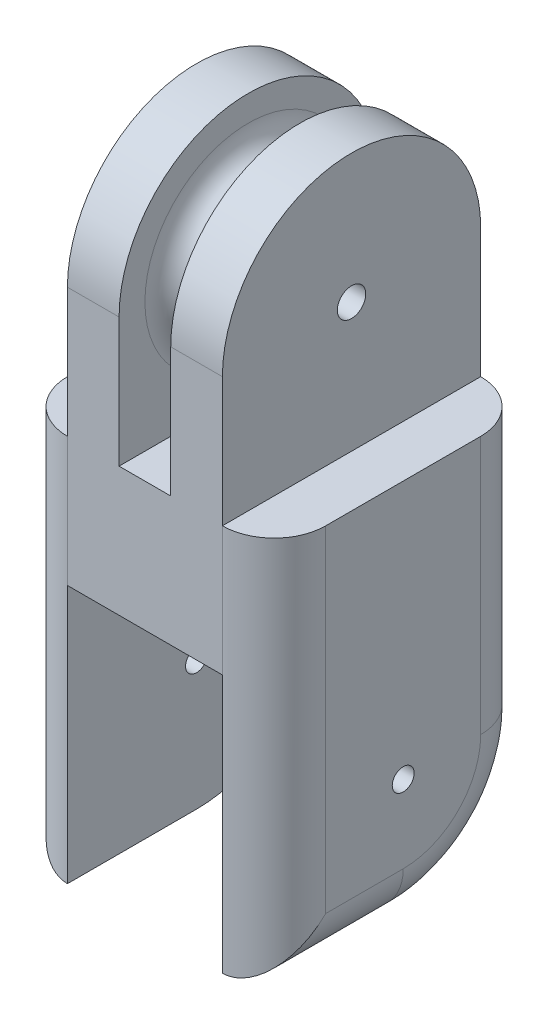
ISO-10303-21;
HEADER;
FILE_DESCRIPTION(('STEP AP214'),'2;1');
FILE_NAME('part.step','',(''),(''),'','','');
FILE_SCHEMA(('AUTOMOTIVE_DESIGN { 1 0 10303 214 1 1 1 1 }'));
ENDSEC;
DATA;
#1=APPLICATION_CONTEXT('core data for automotive mechanical design processes');
#2=APPLICATION_PROTOCOL_DEFINITION('international standard','automotive_design',2000,#1);
#3=PRODUCT_CONTEXT('',#1,'mechanical');
#4=PRODUCT('Part','Part','',(#3));
#5=PRODUCT_RELATED_PRODUCT_CATEGORY('part','',(#4));
#6=PRODUCT_DEFINITION_FORMATION('','',#4);
#7=PRODUCT_DEFINITION_CONTEXT('part definition',#1,'design');
#8=PRODUCT_DEFINITION('design','',#6,#7);
#9=PRODUCT_DEFINITION_SHAPE('','',#8);
#10=(LENGTH_UNIT() NAMED_UNIT(*) SI_UNIT(.MILLI.,.METRE.));
#11=(NAMED_UNIT(*) PLANE_ANGLE_UNIT() SI_UNIT($,.RADIAN.));
#12=(NAMED_UNIT(*) SI_UNIT($,.STERADIAN.) SOLID_ANGLE_UNIT());
#13=UNCERTAINTY_MEASURE_WITH_UNIT(LENGTH_MEASURE(1.E-05),#10,'distance_accuracy_value','');
#14=(GEOMETRIC_REPRESENTATION_CONTEXT(3) GLOBAL_UNCERTAINTY_ASSIGNED_CONTEXT((#13)) GLOBAL_UNIT_ASSIGNED_CONTEXT((#10,
#11,#12)) REPRESENTATION_CONTEXT('',''));
#15=CARTESIAN_POINT('',(0.,0.,0.));
#16=DIRECTION('',(0.,0.,1.));
#17=DIRECTION('',(1.,0.,0.));
#18=AXIS2_PLACEMENT_3D('',#15,#16,#17);
#19=CARTESIAN_POINT('',(0.,10.,0.));
#20=DIRECTION('',(0.,1.,0.));
#21=DIRECTION('',(0.,0.,1.));
#22=AXIS2_PLACEMENT_3D('',#19,#20,#21);
#23=PLANE('',#22);
#24=CARTESIAN_POINT('',(-6.,10.,6.));
#25=DIRECTION('',(0.,1.,0.));
#26=DIRECTION('',(0.,0.,1.));
#27=AXIS2_PLACEMENT_3D('',#24,#25,#26);
#28=CIRCLE('',#27,4.);
#29=CARTESIAN_POINT('',(-10.,10.,6.));
#30=VERTEX_POINT('',#29);
#31=CARTESIAN_POINT('',(-6.,10.,10.));
#32=VERTEX_POINT('',#31);
#33=EDGE_CURVE('E372',#30,#32,#28,.T.);
#34=ORIENTED_EDGE('',*,*,#33,.T.);
#35=DIRECTION('',(0.,0.,1.));
#36=VECTOR('',#35,1.);
#37=CARTESIAN_POINT('',(-6.,10.,10.));
#38=LINE('',#37,#36);
#39=CARTESIAN_POINT('',(-6.,10.,-10.));
#40=VERTEX_POINT('',#39);
#41=EDGE_CURVE('E172',#40,#32,#38,.T.);
#42=ORIENTED_EDGE('',*,*,#41,.F.);
#43=CARTESIAN_POINT('',(-6.,10.,-6.));
#44=DIRECTION('',(0.,1.,0.));
#45=DIRECTION('',(0.,0.,1.));
#46=AXIS2_PLACEMENT_3D('',#43,#44,#45);
#47=CIRCLE('',#46,4.);
#48=CARTESIAN_POINT('',(-10.,10.,-6.));
#49=VERTEX_POINT('',#48);
#50=EDGE_CURVE('E369',#40,#49,#47,.T.);
#51=ORIENTED_EDGE('',*,*,#50,.T.);
#52=DIRECTION('',(0.,0.,1.));
#53=VECTOR('',#52,1.);
#54=CARTESIAN_POINT('',(-10.,10.,-10.));
#55=LINE('',#54,#53);
#56=EDGE_CURVE('E310',#49,#30,#55,.T.);
#57=ORIENTED_EDGE('',*,*,#56,.T.);
#58=EDGE_LOOP('',(#34,#42,#51,#57));
#59=FACE_BOUND('',#58,.T.);
#60=ADVANCED_FACE('F39',(#59),#23,.T.);
#61=CARTESIAN_POINT('',(0.,10.,-6.));
#62=DIRECTION('',(0.,1.,0.));
#63=DIRECTION('',(0.,0.,1.));
#64=AXIS2_PLACEMENT_3D('',#61,#62,#63);
#65=CIRCLE('',#64,0.5);
#66=CARTESIAN_POINT('',(0.,10.,-5.5));
#67=VERTEX_POINT('',#66);
#68=EDGE_CURVE('E426',#67,#67,#65,.F.);
#69=ORIENTED_EDGE('',*,*,#68,.T.);
#70=EDGE_LOOP('',(#69));
#71=FACE_BOUND('',#70,.T.);
#72=CARTESIAN_POINT('',(0.,10.,6.));
#73=DIRECTION('',(0.,1.,0.));
#74=DIRECTION('',(0.,0.,1.));
#75=AXIS2_PLACEMENT_3D('',#72,#73,#74);
#76=CIRCLE('',#75,0.5);
#77=CARTESIAN_POINT('',(0.,10.,6.5));
#78=VERTEX_POINT('',#77);
#79=EDGE_CURVE('E435',#78,#78,#76,.F.);
#80=ORIENTED_EDGE('',*,*,#79,.T.);
#81=EDGE_LOOP('',(#80));
#82=FACE_BOUND('',#81,.T.);
#83=DIRECTION('',(-1.,0.,0.));
#84=VECTOR('',#83,1.);
#85=CARTESIAN_POINT('',(-10.,10.,-10.));
#86=LINE('',#85,#84);
#87=CARTESIAN_POINT('',(2.,10.,-10.));
#88=VERTEX_POINT('',#87);
#89=CARTESIAN_POINT('',(-2.,10.,-10.));
#90=VERTEX_POINT('',#89);
#91=EDGE_CURVE('E322',#88,#90,#86,.T.);
#92=ORIENTED_EDGE('',*,*,#91,.T.);
#93=DIRECTION('',(0.,0.,-1.));
#94=VECTOR('',#93,1.);
#95=CARTESIAN_POINT('',(-2.,10.,10.));
#96=LINE('',#95,#94);
#97=CARTESIAN_POINT('',(-2.,10.,10.));
#98=VERTEX_POINT('',#97);
#99=EDGE_CURVE('E56',#98,#90,#96,.T.);
#100=ORIENTED_EDGE('',*,*,#99,.F.);
#101=DIRECTION('',(1.,0.,0.));
#102=VECTOR('',#101,1.);
#103=CARTESIAN_POINT('',(-10.,10.,10.));
#104=LINE('',#103,#102);
#105=CARTESIAN_POINT('',(2.,10.,10.));
#106=VERTEX_POINT('',#105);
#107=EDGE_CURVE('E314',#98,#106,#104,.T.);
#108=ORIENTED_EDGE('',*,*,#107,.T.);
#109=DIRECTION('',(0.,0.,1.));
#110=VECTOR('',#109,1.);
#111=CARTESIAN_POINT('',(2.,10.,10.));
#112=LINE('',#111,#110);
#113=EDGE_CURVE('E231',#88,#106,#112,.T.);
#114=ORIENTED_EDGE('',*,*,#113,.F.);
#115=EDGE_LOOP('',(#92,#100,#108,#114));
#116=FACE_BOUND('',#115,.T.);
#117=ADVANCED_FACE('F512',(#71,#82,#116),#23,.T.);
#118=DIRECTION('',(0.,0.,-1.));
#119=VECTOR('',#118,1.);
#120=CARTESIAN_POINT('',(6.,10.,10.));
#121=LINE('',#120,#119);
#122=CARTESIAN_POINT('',(6.,10.,10.));
#123=VERTEX_POINT('',#122);
#124=CARTESIAN_POINT('',(6.,10.,-10.));
#125=VERTEX_POINT('',#124);
#126=EDGE_CURVE('E176',#123,#125,#121,.T.);
#127=ORIENTED_EDGE('',*,*,#126,.F.);
#128=CARTESIAN_POINT('',(6.,10.,6.));
#129=DIRECTION('',(0.,1.,0.));
#130=DIRECTION('',(0.,0.,1.));
#131=AXIS2_PLACEMENT_3D('',#128,#129,#130);
#132=CIRCLE('',#131,4.);
#133=CARTESIAN_POINT('',(10.,10.,6.));
#134=VERTEX_POINT('',#133);
#135=EDGE_CURVE('E375',#123,#134,#132,.T.);
#136=ORIENTED_EDGE('',*,*,#135,.T.);
#137=DIRECTION('',(0.,0.,-1.));
#138=VECTOR('',#137,1.);
#139=CARTESIAN_POINT('',(10.,10.,-10.));
#140=LINE('',#139,#138);
#141=CARTESIAN_POINT('',(10.,10.,-6.));
#142=VERTEX_POINT('',#141);
#143=EDGE_CURVE('E318',#134,#142,#140,.T.);
#144=ORIENTED_EDGE('',*,*,#143,.T.);
#145=CARTESIAN_POINT('',(6.,10.,-6.));
#146=DIRECTION('',(0.,1.,0.));
#147=DIRECTION('',(0.,0.,1.));
#148=AXIS2_PLACEMENT_3D('',#145,#146,#147);
#149=CIRCLE('',#148,4.);
#150=EDGE_CURVE('E365',#142,#125,#149,.T.);
#151=ORIENTED_EDGE('',*,*,#150,.T.);
#152=EDGE_LOOP('',(#127,#136,#144,#151));
#153=FACE_BOUND('',#152,.T.);
#154=ADVANCED_FACE('F448',(#153),#23,.T.);
#155=CARTESIAN_POINT('',(0.,0.,0.));
#156=DIRECTION('',(0.,1.,0.));
#157=DIRECTION('',(0.,0.,1.));
#158=AXIS2_PLACEMENT_3D('',#155,#156,#157);
#159=PLANE('',#158);
#160=CARTESIAN_POINT('',(0.,0.,-6.));
#161=DIRECTION('',(0.,-1.,0.));
#162=DIRECTION('',(0.,0.,-1.));
#163=AXIS2_PLACEMENT_3D('',#160,#161,#162);
#164=CIRCLE('',#163,0.5);
#165=CARTESIAN_POINT('',(0.,0.,-6.5));
#166=VERTEX_POINT('',#165);
#167=EDGE_CURVE('E420',#166,#166,#164,.T.);
#168=ORIENTED_EDGE('',*,*,#167,.F.);
#169=EDGE_LOOP('',(#168));
#170=FACE_BOUND('',#169,.T.);
#171=CARTESIAN_POINT('',(0.,0.,6.));
#172=DIRECTION('',(0.,-1.,0.));
#173=DIRECTION('',(0.,0.,1.));
#174=AXIS2_PLACEMENT_3D('',#171,#172,#173);
#175=CIRCLE('',#174,0.5);
#176=CARTESIAN_POINT('',(0.,0.,6.5));
#177=VERTEX_POINT('',#176);
#178=EDGE_CURVE('E432',#177,#177,#175,.T.);
#179=ORIENTED_EDGE('',*,*,#178,.F.);
#180=EDGE_LOOP('',(#179));
#181=FACE_BOUND('',#180,.T.);
#182=DIRECTION('',(0.,0.,-1.));
#183=VECTOR('',#182,1.);
#184=CARTESIAN_POINT('',(6.,0.,-10.));
#185=LINE('',#184,#183);
#186=CARTESIAN_POINT('',(6.,0.,10.));
#187=VERTEX_POINT('',#186);
#188=CARTESIAN_POINT('',(6.,0.,-10.));
#189=VERTEX_POINT('',#188);
#190=EDGE_CURVE('E286',#187,#189,#185,.T.);
#191=ORIENTED_EDGE('',*,*,#190,.F.);
#192=DIRECTION('',(1.,0.,0.));
#193=VECTOR('',#192,1.);
#194=CARTESIAN_POINT('',(-10.,0.,10.));
#195=LINE('',#194,#193);
#196=CARTESIAN_POINT('',(-6.,0.,10.));
#197=VERTEX_POINT('',#196);
#198=EDGE_CURVE('E309',#197,#187,#195,.T.);
#199=ORIENTED_EDGE('',*,*,#198,.F.);
#200=DIRECTION('',(0.,0.,1.));
#201=VECTOR('',#200,1.);
#202=CARTESIAN_POINT('',(-6.,0.,10.));
#203=LINE('',#202,#201);
#204=CARTESIAN_POINT('',(-6.,0.,-10.));
#205=VERTEX_POINT('',#204);
#206=EDGE_CURVE('E297',#205,#197,#203,.T.);
#207=ORIENTED_EDGE('',*,*,#206,.F.);
#208=DIRECTION('',(-1.,0.,0.));
#209=VECTOR('',#208,1.);
#210=CARTESIAN_POINT('',(-10.,0.,-10.));
#211=LINE('',#210,#209);
#212=EDGE_CURVE('E315',#189,#205,#211,.T.);
#213=ORIENTED_EDGE('',*,*,#212,.F.);
#214=EDGE_LOOP('',(#191,#199,#207,#213));
#215=FACE_BOUND('',#214,.T.);
#216=ADVANCED_FACE('F444',(#170,#181,#215),#159,.F.);
#217=CARTESIAN_POINT('',(-10.,10.,-10.));
#218=DIRECTION('',(1.,0.,0.));
#219=DIRECTION('',(0.,0.,-1.));
#220=AXIS2_PLACEMENT_3D('',#217,#218,#219);
#221=PLANE('',#220);
#222=CARTESIAN_POINT('',(-10.,-10.,0.));
#223=DIRECTION('',(-1.,0.,0.));
#224=DIRECTION('',(0.,0.,1.));
#225=AXIS2_PLACEMENT_3D('',#222,#223,#224);
#226=CIRCLE('',#225,0.85);
#227=CARTESIAN_POINT('',(-10.,-10.,0.850000000000001));
#228=VERTEX_POINT('',#227);
#229=EDGE_CURVE('E261',#228,#228,#226,.T.);
#230=ORIENTED_EDGE('',*,*,#229,.F.);
#231=EDGE_LOOP('',(#230));
#232=FACE_BOUND('',#231,.T.);
#233=DIRECTION('',(0.,0.,1.));
#234=VECTOR('',#233,1.);
#235=CARTESIAN_POINT('',(-10.,-16.,10.));
#236=LINE('',#235,#234);
#237=CARTESIAN_POINT('',(-10.,-16.,0.));
#238=VERTEX_POINT('',#237);
#239=CARTESIAN_POINT('',(-10.,-16.,6.));
#240=VERTEX_POINT('',#239);
#241=EDGE_CURVE('E338',#238,#240,#236,.T.);
#242=ORIENTED_EDGE('',*,*,#241,.T.);
#243=DIRECTION('',(0.,-1.,0.));
#244=VECTOR('',#243,1.);
#245=CARTESIAN_POINT('',(-10.,10.,6.));
#246=LINE('',#245,#244);
#247=EDGE_CURVE('E342',#240,#30,#246,.F.);
#248=ORIENTED_EDGE('',*,*,#247,.T.);
#249=ORIENTED_EDGE('',*,*,#56,.F.);
#250=DIRECTION('',(0.,-1.,0.));
#251=VECTOR('',#250,1.);
#252=CARTESIAN_POINT('',(-10.,10.,-6.));
#253=LINE('',#252,#251);
#254=CARTESIAN_POINT('',(-10.,-10.,-6.));
#255=VERTEX_POINT('',#254);
#256=EDGE_CURVE('E325',#49,#255,#253,.T.);
#257=ORIENTED_EDGE('',*,*,#256,.T.);
#258=CARTESIAN_POINT('',(-10.,-10.,0.));
#259=DIRECTION('',(1.,0.,0.));
#260=DIRECTION('',(0.,0.,-1.));
#261=AXIS2_PLACEMENT_3D('',#258,#259,#260);
#262=CIRCLE('',#261,6.);
#263=EDGE_CURVE('E335',#255,#238,#262,.F.);
#264=ORIENTED_EDGE('',*,*,#263,.T.);
#265=EDGE_LOOP('',(#242,#248,#249,#257,#264));
#266=FACE_BOUND('',#265,.T.);
#267=ADVANCED_FACE('F447',(#232,#266),#221,.F.);
#268=CARTESIAN_POINT('',(-10.,10.,10.));
#269=DIRECTION('',(0.,0.,-1.));
#270=DIRECTION('',(-1.,0.,0.));
#271=AXIS2_PLACEMENT_3D('',#268,#269,#270);
#272=PLANE('',#271);
#273=ORIENTED_EDGE('',*,*,#198,.T.);
#274=DIRECTION('',(0.,-1.,0.));
#275=VECTOR('',#274,1.);
#276=CARTESIAN_POINT('',(6.,10.,10.));
#277=LINE('',#276,#275);
#278=EDGE_CURVE('E361',#187,#123,#277,.F.);
#279=ORIENTED_EDGE('',*,*,#278,.T.);
#280=DIRECTION('',(0.,-1.,0.));
#281=VECTOR('',#280,1.);
#282=CARTESIAN_POINT('',(6.,20.,10.));
#283=LINE('',#282,#281);
#284=CARTESIAN_POINT('',(6.,20.,10.));
#285=VERTEX_POINT('',#284);
#286=EDGE_CURVE('E235',#285,#123,#283,.T.);
#287=ORIENTED_EDGE('',*,*,#286,.F.);
#288=DIRECTION('',(1.,0.,0.));
#289=VECTOR('',#288,1.);
#290=CARTESIAN_POINT('',(6.,20.,10.));
#291=LINE('',#290,#289);
#292=CARTESIAN_POINT('',(2.,20.,10.));
#293=VERTEX_POINT('',#292);
#294=EDGE_CURVE('E230',#293,#285,#291,.T.);
#295=ORIENTED_EDGE('',*,*,#294,.F.);
#296=DIRECTION('',(0.,-1.,0.));
#297=VECTOR('',#296,1.);
#298=CARTESIAN_POINT('',(2.,20.,10.));
#299=LINE('',#298,#297);
#300=EDGE_CURVE('E243',#293,#106,#299,.T.);
#301=ORIENTED_EDGE('',*,*,#300,.T.);
#302=ORIENTED_EDGE('',*,*,#107,.F.);
#303=DIRECTION('',(0.,-1.,0.));
#304=VECTOR('',#303,1.);
#305=CARTESIAN_POINT('',(-2.,20.,10.));
#306=LINE('',#305,#304);
#307=CARTESIAN_POINT('',(-2.,20.,10.));
#308=VERTEX_POINT('',#307);
#309=EDGE_CURVE('E177',#308,#98,#306,.T.);
#310=ORIENTED_EDGE('',*,*,#309,.F.);
#311=DIRECTION('',(1.,0.,0.));
#312=VECTOR('',#311,1.);
#313=CARTESIAN_POINT('',(-6.,20.,10.));
#314=LINE('',#313,#312);
#315=CARTESIAN_POINT('',(-6.,20.,10.));
#316=VERTEX_POINT('',#315);
#317=EDGE_CURVE('E180',#316,#308,#314,.T.);
#318=ORIENTED_EDGE('',*,*,#317,.F.);
#319=DIRECTION('',(0.,-1.,0.));
#320=VECTOR('',#319,1.);
#321=CARTESIAN_POINT('',(-6.,20.,10.));
#322=LINE('',#321,#320);
#323=EDGE_CURVE('E165',#316,#32,#322,.T.);
#324=ORIENTED_EDGE('',*,*,#323,.T.);
#325=DIRECTION('',(0.,-1.,0.));
#326=VECTOR('',#325,1.);
#327=CARTESIAN_POINT('',(-6.,10.,10.));
#328=LINE('',#327,#326);
#329=EDGE_CURVE('E358',#32,#197,#328,.T.);
#330=ORIENTED_EDGE('',*,*,#329,.T.);
#331=EDGE_LOOP('',(#273,#279,#287,#295,#301,#302,#310,#318,#324,#330));
#332=FACE_BOUND('',#331,.T.);
#333=ADVANCED_FACE('F182',(#332),#272,.F.);
#334=CARTESIAN_POINT('',(10.,10.,-10.));
#335=DIRECTION('',(-1.,0.,0.));
#336=DIRECTION('',(0.,0.,1.));
#337=AXIS2_PLACEMENT_3D('',#334,#335,#336);
#338=PLANE('',#337);
#339=CARTESIAN_POINT('',(10.,-10.,0.));
#340=DIRECTION('',(-1.,0.,0.));
#341=DIRECTION('',(0.,0.,1.));
#342=AXIS2_PLACEMENT_3D('',#339,#340,#341);
#343=CIRCLE('',#342,0.85);
#344=CARTESIAN_POINT('',(10.,-10.,0.849999999999999));
#345=VERTEX_POINT('',#344);
#346=EDGE_CURVE('E256',#345,#345,#343,.T.);
#347=ORIENTED_EDGE('',*,*,#346,.T.);
#348=EDGE_LOOP('',(#347));
#349=FACE_BOUND('',#348,.T.);
#350=ORIENTED_EDGE('',*,*,#143,.F.);
#351=DIRECTION('',(0.,-1.,0.));
#352=VECTOR('',#351,1.);
#353=CARTESIAN_POINT('',(10.,10.,6.));
#354=LINE('',#353,#352);
#355=CARTESIAN_POINT('',(10.,-16.,6.));
#356=VERTEX_POINT('',#355);
#357=EDGE_CURVE('E355',#134,#356,#354,.T.);
#358=ORIENTED_EDGE('',*,*,#357,.T.);
#359=DIRECTION('',(0.,0.,-1.));
#360=VECTOR('',#359,1.);
#361=CARTESIAN_POINT('',(10.,-16.,0.));
#362=LINE('',#361,#360);
#363=CARTESIAN_POINT('',(10.,-16.,0.));
#364=VERTEX_POINT('',#363);
#365=EDGE_CURVE('E351',#356,#364,#362,.T.);
#366=ORIENTED_EDGE('',*,*,#365,.T.);
#367=CARTESIAN_POINT('',(10.,-10.,0.));
#368=DIRECTION('',(-1.,0.,0.));
#369=DIRECTION('',(0.,0.,1.));
#370=AXIS2_PLACEMENT_3D('',#367,#368,#369);
#371=CIRCLE('',#370,6.);
#372=CARTESIAN_POINT('',(10.,-10.,-6.));
#373=VERTEX_POINT('',#372);
#374=EDGE_CURVE('E348',#364,#373,#371,.F.);
#375=ORIENTED_EDGE('',*,*,#374,.T.);
#376=DIRECTION('',(0.,-1.,0.));
#377=VECTOR('',#376,1.);
#378=CARTESIAN_POINT('',(10.,10.,-6.));
#379=LINE('',#378,#377);
#380=EDGE_CURVE('E345',#373,#142,#379,.F.);
#381=ORIENTED_EDGE('',*,*,#380,.T.);
#382=EDGE_LOOP('',(#350,#358,#366,#375,#381));
#383=FACE_BOUND('',#382,.T.);
#384=ADVANCED_FACE('F507',(#349,#383),#338,.F.);
#385=CARTESIAN_POINT('',(-10.,10.,-10.));
#386=DIRECTION('',(0.,0.,1.));
#387=DIRECTION('',(1.,0.,0.));
#388=AXIS2_PLACEMENT_3D('',#385,#386,#387);
#389=PLANE('',#388);
#390=ORIENTED_EDGE('',*,*,#212,.T.);
#391=DIRECTION('',(0.,-1.,0.));
#392=VECTOR('',#391,1.);
#393=CARTESIAN_POINT('',(-6.,10.,-10.));
#394=LINE('',#393,#392);
#395=EDGE_CURVE('E381',#205,#40,#394,.F.);
#396=ORIENTED_EDGE('',*,*,#395,.T.);
#397=DIRECTION('',(0.,-1.,0.));
#398=VECTOR('',#397,1.);
#399=CARTESIAN_POINT('',(-6.,20.,-10.));
#400=LINE('',#399,#398);
#401=CARTESIAN_POINT('',(-6.,20.,-10.));
#402=VERTEX_POINT('',#401);
#403=EDGE_CURVE('E213',#402,#40,#400,.T.);
#404=ORIENTED_EDGE('',*,*,#403,.F.);
#405=DIRECTION('',(-1.,0.,0.));
#406=VECTOR('',#405,1.);
#407=CARTESIAN_POINT('',(-6.,20.,-10.));
#408=LINE('',#407,#406);
#409=CARTESIAN_POINT('',(-2.,20.,-10.));
#410=VERTEX_POINT('',#409);
#411=EDGE_CURVE('E187',#410,#402,#408,.T.);
#412=ORIENTED_EDGE('',*,*,#411,.F.);
#413=DIRECTION('',(0.,-1.,0.));
#414=VECTOR('',#413,1.);
#415=CARTESIAN_POINT('',(-2.,20.,-10.));
#416=LINE('',#415,#414);
#417=EDGE_CURVE('E220',#410,#90,#416,.T.);
#418=ORIENTED_EDGE('',*,*,#417,.T.);
#419=ORIENTED_EDGE('',*,*,#91,.F.);
#420=DIRECTION('',(0.,-1.,0.));
#421=VECTOR('',#420,1.);
#422=CARTESIAN_POINT('',(2.,20.,-10.));
#423=LINE('',#422,#421);
#424=CARTESIAN_POINT('',(2.,20.,-10.));
#425=VERTEX_POINT('',#424);
#426=EDGE_CURVE('E247',#425,#88,#423,.T.);
#427=ORIENTED_EDGE('',*,*,#426,.F.);
#428=DIRECTION('',(-1.,0.,0.));
#429=VECTOR('',#428,1.);
#430=CARTESIAN_POINT('',(6.,20.,-10.));
#431=LINE('',#430,#429);
#432=CARTESIAN_POINT('',(6.,20.,-10.));
#433=VERTEX_POINT('',#432);
#434=EDGE_CURVE('E226',#433,#425,#431,.T.);
#435=ORIENTED_EDGE('',*,*,#434,.F.);
#436=DIRECTION('',(0.,-1.,0.));
#437=VECTOR('',#436,1.);
#438=CARTESIAN_POINT('',(6.,20.,-10.));
#439=LINE('',#438,#437);
#440=EDGE_CURVE('E251',#433,#125,#439,.T.);
#441=ORIENTED_EDGE('',*,*,#440,.T.);
#442=DIRECTION('',(0.,-1.,0.));
#443=VECTOR('',#442,1.);
#444=CARTESIAN_POINT('',(6.,10.,-10.));
#445=LINE('',#444,#443);
#446=EDGE_CURVE('E378',#125,#189,#445,.T.);
#447=ORIENTED_EDGE('',*,*,#446,.T.);
#448=EDGE_LOOP('',(#390,#396,#404,#412,#418,#419,#427,#435,#441,#447));
#449=FACE_BOUND('',#448,.T.);
#450=ADVANCED_FACE('F477',(#449),#389,.F.);
#451=CARTESIAN_POINT('',(-6.,-10.,10.));
#452=DIRECTION('',(-1.,0.,0.));
#453=DIRECTION('',(0.,0.,1.));
#454=AXIS2_PLACEMENT_3D('',#451,#452,#453);
#455=PLANE('',#454);
#456=CARTESIAN_POINT('',(-6.,-10.,0.));
#457=DIRECTION('',(-1.,0.,0.));
#458=DIRECTION('',(0.,0.,1.));
#459=AXIS2_PLACEMENT_3D('',#456,#457,#458);
#460=CIRCLE('',#459,0.85);
#461=CARTESIAN_POINT('',(-6.,-10.,0.850000000000001));
#462=VERTEX_POINT('',#461);
#463=EDGE_CURVE('E266',#462,#462,#460,.T.);
#464=ORIENTED_EDGE('',*,*,#463,.T.);
#465=EDGE_LOOP('',(#464));
#466=FACE_BOUND('',#465,.T.);
#467=ORIENTED_EDGE('',*,*,#206,.T.);
#468=DIRECTION('',(0.,1.,0.));
#469=VECTOR('',#468,1.);
#470=CARTESIAN_POINT('',(-6.,-10.,10.));
#471=LINE('',#470,#469);
#472=CARTESIAN_POINT('',(-6.,-20.,10.));
#473=VERTEX_POINT('',#472);
#474=EDGE_CURVE('E301',#473,#197,#471,.T.);
#475=ORIENTED_EDGE('',*,*,#474,.F.);
#476=DIRECTION('',(0.,0.,1.));
#477=VECTOR('',#476,1.);
#478=CARTESIAN_POINT('',(-6.,-20.,0.));
#479=LINE('',#478,#477);
#480=CARTESIAN_POINT('',(-6.,-20.,0.));
#481=VERTEX_POINT('',#480);
#482=EDGE_CURVE('E282',#481,#473,#479,.T.);
#483=ORIENTED_EDGE('',*,*,#482,.F.);
#484=CARTESIAN_POINT('',(-6.,-10.,0.));
#485=DIRECTION('',(-1.,0.,0.));
#486=DIRECTION('',(0.,0.,1.));
#487=AXIS2_PLACEMENT_3D('',#484,#485,#486);
#488=CIRCLE('',#487,10.);
#489=CARTESIAN_POINT('',(-6.,-10.,-10.));
#490=VERTEX_POINT('',#489);
#491=EDGE_CURVE('E278',#490,#481,#488,.T.);
#492=ORIENTED_EDGE('',*,*,#491,.F.);
#493=DIRECTION('',(0.,1.,0.));
#494=VECTOR('',#493,1.);
#495=CARTESIAN_POINT('',(-6.,-10.,-10.));
#496=LINE('',#495,#494);
#497=EDGE_CURVE('E305',#490,#205,#496,.T.);
#498=ORIENTED_EDGE('',*,*,#497,.T.);
#499=EDGE_LOOP('',(#467,#475,#483,#492,#498));
#500=FACE_BOUND('',#499,.T.);
#501=ADVANCED_FACE('F489',(#466,#500),#455,.F.);
#502=CARTESIAN_POINT('',(6.,-10.,-10.));
#503=DIRECTION('',(1.,0.,0.));
#504=DIRECTION('',(0.,0.,-1.));
#505=AXIS2_PLACEMENT_3D('',#502,#503,#504);
#506=PLANE('',#505);
#507=CARTESIAN_POINT('',(6.,-10.,0.));
#508=DIRECTION('',(1.,0.,0.));
#509=DIRECTION('',(0.,0.,-1.));
#510=AXIS2_PLACEMENT_3D('',#507,#508,#509);
#511=CIRCLE('',#510,0.85);
#512=CARTESIAN_POINT('',(6.,-10.,-0.850000000000001));
#513=VERTEX_POINT('',#512);
#514=EDGE_CURVE('E260',#513,#513,#511,.T.);
#515=ORIENTED_EDGE('',*,*,#514,.T.);
#516=EDGE_LOOP('',(#515));
#517=FACE_BOUND('',#516,.T.);
#518=ORIENTED_EDGE('',*,*,#190,.T.);
#519=DIRECTION('',(0.,1.,0.));
#520=VECTOR('',#519,1.);
#521=CARTESIAN_POINT('',(6.,-10.,-10.));
#522=LINE('',#521,#520);
#523=CARTESIAN_POINT('',(6.,-10.,-10.));
#524=VERTEX_POINT('',#523);
#525=EDGE_CURVE('E290',#524,#189,#522,.T.);
#526=ORIENTED_EDGE('',*,*,#525,.F.);
#527=CARTESIAN_POINT('',(6.,-10.,0.));
#528=DIRECTION('',(1.,0.,0.));
#529=DIRECTION('',(0.,0.,-1.));
#530=AXIS2_PLACEMENT_3D('',#527,#528,#529);
#531=CIRCLE('',#530,10.);
#532=CARTESIAN_POINT('',(6.,-20.,0.));
#533=VERTEX_POINT('',#532);
#534=EDGE_CURVE('E274',#533,#524,#531,.T.);
#535=ORIENTED_EDGE('',*,*,#534,.F.);
#536=DIRECTION('',(0.,0.,-1.));
#537=VECTOR('',#536,1.);
#538=CARTESIAN_POINT('',(6.,-20.,0.));
#539=LINE('',#538,#537);
#540=CARTESIAN_POINT('',(6.,-20.,9.99999999999999));
#541=VERTEX_POINT('',#540);
#542=EDGE_CURVE('E270',#541,#533,#539,.T.);
#543=ORIENTED_EDGE('',*,*,#542,.F.);
#544=DIRECTION('',(0.,1.,0.));
#545=VECTOR('',#544,1.);
#546=CARTESIAN_POINT('',(6.,-10.,10.));
#547=LINE('',#546,#545);
#548=EDGE_CURVE('E294',#541,#187,#547,.T.);
#549=ORIENTED_EDGE('',*,*,#548,.T.);
#550=EDGE_LOOP('',(#518,#526,#535,#543,#549));
#551=FACE_BOUND('',#550,.T.);
#552=ADVANCED_FACE('F528',(#517,#551),#506,.F.);
#553=CARTESIAN_POINT('',(10.,-10.,0.));
#554=DIRECTION('',(-1.,0.,0.));
#555=DIRECTION('',(0.,0.,1.));
#556=AXIS2_PLACEMENT_3D('',#553,#554,#555);
#557=CYLINDRICAL_SURFACE('',#556,0.85);
#558=ORIENTED_EDGE('',*,*,#346,.F.);
#559=EDGE_LOOP('',(#558));
#560=FACE_BOUND('',#559,.T.);
#561=ORIENTED_EDGE('',*,*,#514,.F.);
#562=EDGE_LOOP('',(#561));
#563=FACE_BOUND('',#562,.T.);
#564=ADVANCED_FACE('F546',(#560,#563),#557,.F.);
#565=ORIENTED_EDGE('',*,*,#229,.T.);
#566=EDGE_LOOP('',(#565));
#567=FACE_BOUND('',#566,.T.);
#568=ORIENTED_EDGE('',*,*,#463,.F.);
#569=EDGE_LOOP('',(#568));
#570=FACE_BOUND('',#569,.T.);
#571=ADVANCED_FACE('F549',(#567,#570),#557,.F.);
#572=CARTESIAN_POINT('',(-6.,10.,-6.));
#573=DIRECTION('',(0.,-1.,0.));
#574=DIRECTION('',(0.,0.,-1.));
#575=AXIS2_PLACEMENT_3D('',#572,#573,#574);
#576=CYLINDRICAL_SURFACE('',#575,4.);
#577=ORIENTED_EDGE('',*,*,#395,.F.);
#578=ORIENTED_EDGE('',*,*,#497,.F.);
#579=CARTESIAN_POINT('',(-6.,-10.,-6.));
#580=DIRECTION('',(0.,-1.,0.));
#581=DIRECTION('',(0.,0.,-1.));
#582=AXIS2_PLACEMENT_3D('',#579,#580,#581);
#583=CIRCLE('',#582,4.);
#584=EDGE_CURVE('E265',#255,#490,#583,.T.);
#585=ORIENTED_EDGE('',*,*,#584,.F.);
#586=ORIENTED_EDGE('',*,*,#256,.F.);
#587=ORIENTED_EDGE('',*,*,#50,.F.);
#588=EDGE_LOOP('',(#577,#578,#585,#586,#587));
#589=FACE_BOUND('',#588,.T.);
#590=ADVANCED_FACE('F498',(#589),#576,.T.);
#591=CARTESIAN_POINT('',(-6.,-10.,0.));
#592=DIRECTION('',(1.,0.,0.));
#593=DIRECTION('',(0.,0.,-1.));
#594=AXIS2_PLACEMENT_3D('',#591,#592,#593);
#595=TOROIDAL_SURFACE('',#594,6.,4.);
#596=ORIENTED_EDGE('',*,*,#584,.T.);
#597=ORIENTED_EDGE('',*,*,#491,.T.);
#598=CARTESIAN_POINT('',(-6.,-16.,0.));
#599=DIRECTION('',(0.,0.,1.));
#600=DIRECTION('',(1.,0.,0.));
#601=AXIS2_PLACEMENT_3D('',#598,#599,#600);
#602=CIRCLE('',#601,4.);
#603=EDGE_CURVE('E388',#238,#481,#602,.T.);
#604=ORIENTED_EDGE('',*,*,#603,.F.);
#605=ORIENTED_EDGE('',*,*,#263,.F.);
#606=EDGE_LOOP('',(#596,#597,#604,#605));
#607=FACE_BOUND('',#606,.T.);
#608=ADVANCED_FACE('F496',(#607),#595,.T.);
#609=CARTESIAN_POINT('',(-6.,10.,6.));
#610=DIRECTION('',(0.,-1.,0.));
#611=DIRECTION('',(0.,0.,-1.));
#612=AXIS2_PLACEMENT_3D('',#609,#610,#611);
#613=CYLINDRICAL_SURFACE('',#612,4.);
#614=ORIENTED_EDGE('',*,*,#33,.F.);
#615=ORIENTED_EDGE('',*,*,#247,.F.);
#616=CARTESIAN_POINT('',(-6.,-16.,6.));
#617=DIRECTION('',(0.,-0.707106781186547,-0.707106781186547));
#618=DIRECTION('',(0.,-0.707106781186547,0.707106781186547));
#619=AXIS2_PLACEMENT_3D('',#616,#617,#618);
#620=ELLIPSE('',#619,5.65685424949238,4.);
#621=EDGE_CURVE('E385',#473,#240,#620,.T.);
#622=ORIENTED_EDGE('',*,*,#621,.F.);
#623=ORIENTED_EDGE('',*,*,#474,.T.);
#624=ORIENTED_EDGE('',*,*,#329,.F.);
#625=EDGE_LOOP('',(#614,#615,#622,#623,#624));
#626=FACE_BOUND('',#625,.T.);
#627=ADVANCED_FACE('F486',(#626),#613,.T.);
#628=CARTESIAN_POINT('',(-6.,-16.,-10.));
#629=DIRECTION('',(0.,0.,-1.));
#630=DIRECTION('',(-1.,0.,0.));
#631=AXIS2_PLACEMENT_3D('',#628,#629,#630);
#632=CYLINDRICAL_SURFACE('',#631,4.);
#633=ORIENTED_EDGE('',*,*,#603,.T.);
#634=ORIENTED_EDGE('',*,*,#482,.T.);
#635=ORIENTED_EDGE('',*,*,#621,.T.);
#636=ORIENTED_EDGE('',*,*,#241,.F.);
#637=EDGE_LOOP('',(#633,#634,#635,#636));
#638=FACE_BOUND('',#637,.T.);
#639=ADVANCED_FACE('F491',(#638),#632,.T.);
#640=CARTESIAN_POINT('',(6.,10.,-6.));
#641=DIRECTION('',(0.,-1.,0.));
#642=DIRECTION('',(0.,0.,-1.));
#643=AXIS2_PLACEMENT_3D('',#640,#641,#642);
#644=CYLINDRICAL_SURFACE('',#643,4.);
#645=ORIENTED_EDGE('',*,*,#150,.F.);
#646=ORIENTED_EDGE('',*,*,#380,.F.);
#647=CARTESIAN_POINT('',(6.,-10.,-6.));
#648=DIRECTION('',(0.,-1.,0.));
#649=DIRECTION('',(0.,0.,-1.));
#650=AXIS2_PLACEMENT_3D('',#647,#648,#649);
#651=CIRCLE('',#650,4.);
#652=EDGE_CURVE('E389',#524,#373,#651,.T.);
#653=ORIENTED_EDGE('',*,*,#652,.F.);
#654=ORIENTED_EDGE('',*,*,#525,.T.);
#655=ORIENTED_EDGE('',*,*,#446,.F.);
#656=EDGE_LOOP('',(#645,#646,#653,#654,#655));
#657=FACE_BOUND('',#656,.T.);
#658=ADVANCED_FACE('F526',(#657),#644,.T.);
#659=CARTESIAN_POINT('',(6.,10.,6.));
#660=DIRECTION('',(0.,-1.,0.));
#661=DIRECTION('',(0.,0.,-1.));
#662=AXIS2_PLACEMENT_3D('',#659,#660,#661);
#663=CYLINDRICAL_SURFACE('',#662,4.);
#664=ORIENTED_EDGE('',*,*,#278,.F.);
#665=ORIENTED_EDGE('',*,*,#548,.F.);
#666=CARTESIAN_POINT('',(6.,-16.,6.));
#667=DIRECTION('',(0.,-0.707106781186547,-0.707106781186547));
#668=DIRECTION('',(0.,-0.707106781186547,0.707106781186547));
#669=AXIS2_PLACEMENT_3D('',#666,#667,#668);
#670=ELLIPSE('',#669,5.65685424949238,4.);
#671=EDGE_CURVE('E398',#356,#541,#670,.T.);
#672=ORIENTED_EDGE('',*,*,#671,.F.);
#673=ORIENTED_EDGE('',*,*,#357,.F.);
#674=ORIENTED_EDGE('',*,*,#135,.F.);
#675=EDGE_LOOP('',(#664,#665,#672,#673,#674));
#676=FACE_BOUND('',#675,.T.);
#677=ADVANCED_FACE('F461',(#676),#663,.T.);
#678=CARTESIAN_POINT('',(6.,-10.,0.));
#679=DIRECTION('',(-1.,0.,0.));
#680=DIRECTION('',(0.,0.,1.));
#681=AXIS2_PLACEMENT_3D('',#678,#679,#680);
#682=TOROIDAL_SURFACE('',#681,6.,4.);
#683=ORIENTED_EDGE('',*,*,#652,.T.);
#684=ORIENTED_EDGE('',*,*,#374,.F.);
#685=CARTESIAN_POINT('',(6.,-16.,0.));
#686=DIRECTION('',(0.,0.,1.));
#687=DIRECTION('',(1.,0.,0.));
#688=AXIS2_PLACEMENT_3D('',#685,#686,#687);
#689=CIRCLE('',#688,4.);
#690=EDGE_CURVE('E255',#533,#364,#689,.T.);
#691=ORIENTED_EDGE('',*,*,#690,.F.);
#692=ORIENTED_EDGE('',*,*,#534,.T.);
#693=EDGE_LOOP('',(#683,#684,#691,#692));
#694=FACE_BOUND('',#693,.T.);
#695=ADVANCED_FACE('F535',(#694),#682,.T.);
#696=CARTESIAN_POINT('',(6.,-16.,-10.));
#697=DIRECTION('',(0.,0.,1.));
#698=DIRECTION('',(1.,0.,0.));
#699=AXIS2_PLACEMENT_3D('',#696,#697,#698);
#700=CYLINDRICAL_SURFACE('',#699,4.);
#701=ORIENTED_EDGE('',*,*,#671,.T.);
#702=ORIENTED_EDGE('',*,*,#542,.T.);
#703=ORIENTED_EDGE('',*,*,#690,.T.);
#704=ORIENTED_EDGE('',*,*,#365,.F.);
#705=EDGE_LOOP('',(#701,#702,#703,#704));
#706=FACE_BOUND('',#705,.T.);
#707=ADVANCED_FACE('F532',(#706),#700,.T.);
#708=CARTESIAN_POINT('',(6.,20.,10.));
#709=DIRECTION('',(-1.,0.,0.));
#710=DIRECTION('',(0.,0.,1.));
#711=AXIS2_PLACEMENT_3D('',#708,#709,#710);
#712=PLANE('',#711);
#713=CARTESIAN_POINT('',(6.,20.,0.));
#714=DIRECTION('',(-1.,0.,0.));
#715=DIRECTION('',(0.,0.,1.));
#716=AXIS2_PLACEMENT_3D('',#713,#714,#715);
#717=CIRCLE('',#716,1.1);
#718=CARTESIAN_POINT('',(6.,20.,1.1));
#719=VERTEX_POINT('',#718);
#720=EDGE_CURVE('E194',#719,#719,#717,.T.);
#721=ORIENTED_EDGE('',*,*,#720,.T.);
#722=EDGE_LOOP('',(#721));
#723=FACE_BOUND('',#722,.T.);
#724=ORIENTED_EDGE('',*,*,#126,.T.);
#725=ORIENTED_EDGE('',*,*,#440,.F.);
#726=CARTESIAN_POINT('',(6.,20.,0.));
#727=DIRECTION('',(1.,0.,0.));
#728=DIRECTION('',(0.,0.,-1.));
#729=AXIS2_PLACEMENT_3D('',#726,#727,#728);
#730=CIRCLE('',#729,10.);
#731=EDGE_CURVE('E198',#433,#285,#730,.T.);
#732=ORIENTED_EDGE('',*,*,#731,.T.);
#733=ORIENTED_EDGE('',*,*,#286,.T.);
#734=EDGE_LOOP('',(#724,#725,#732,#733));
#735=FACE_BOUND('',#734,.T.);
#736=ADVANCED_FACE('F467',(#723,#735),#712,.F.);
#737=CARTESIAN_POINT('',(2.,20.,10.));
#738=DIRECTION('',(1.,0.,0.));
#739=DIRECTION('',(0.,0.,-1.));
#740=AXIS2_PLACEMENT_3D('',#737,#738,#739);
#741=PLANE('',#740);
#742=CARTESIAN_POINT('',(2.,20.,0.));
#743=DIRECTION('',(1.,0.,0.));
#744=DIRECTION('',(0.,0.,-1.));
#745=AXIS2_PLACEMENT_3D('',#742,#743,#744);
#746=CIRCLE('',#745,8.);
#747=CARTESIAN_POINT('',(2.,20.,-8.));
#748=VERTEX_POINT('',#747);
#749=EDGE_CURVE('E49',#748,#748,#746,.T.);
#750=ORIENTED_EDGE('',*,*,#749,.T.);
#751=EDGE_LOOP('',(#750));
#752=FACE_BOUND('',#751,.T.);
#753=ORIENTED_EDGE('',*,*,#113,.T.);
#754=ORIENTED_EDGE('',*,*,#300,.F.);
#755=CARTESIAN_POINT('',(2.,20.,0.));
#756=DIRECTION('',(1.,0.,0.));
#757=DIRECTION('',(0.,0.,-1.));
#758=AXIS2_PLACEMENT_3D('',#755,#756,#757);
#759=CIRCLE('',#758,10.);
#760=EDGE_CURVE('E204',#425,#293,#759,.T.);
#761=ORIENTED_EDGE('',*,*,#760,.F.);
#762=ORIENTED_EDGE('',*,*,#426,.T.);
#763=EDGE_LOOP('',(#753,#754,#761,#762));
#764=FACE_BOUND('',#763,.T.);
#765=ADVANCED_FACE('F409',(#752,#764),#741,.F.);
#766=CARTESIAN_POINT('',(-6.,20.,10.));
#767=DIRECTION('',(1.,0.,0.));
#768=DIRECTION('',(0.,0.,-1.));
#769=AXIS2_PLACEMENT_3D('',#766,#767,#768);
#770=PLANE('',#769);
#771=CARTESIAN_POINT('',(-6.,20.,0.));
#772=DIRECTION('',(-1.,0.,0.));
#773=DIRECTION('',(0.,0.,1.));
#774=AXIS2_PLACEMENT_3D('',#771,#772,#773);
#775=CIRCLE('',#774,1.1);
#776=CARTESIAN_POINT('',(-6.,20.,1.1));
#777=VERTEX_POINT('',#776);
#778=EDGE_CURVE('E201',#777,#777,#775,.T.);
#779=ORIENTED_EDGE('',*,*,#778,.F.);
#780=EDGE_LOOP('',(#779));
#781=FACE_BOUND('',#780,.T.);
#782=ORIENTED_EDGE('',*,*,#41,.T.);
#783=ORIENTED_EDGE('',*,*,#323,.F.);
#784=CARTESIAN_POINT('',(-6.,20.,0.));
#785=DIRECTION('',(-1.,0.,0.));
#786=DIRECTION('',(0.,0.,1.));
#787=AXIS2_PLACEMENT_3D('',#784,#785,#786);
#788=CIRCLE('',#787,10.);
#789=EDGE_CURVE('E170',#316,#402,#788,.T.);
#790=ORIENTED_EDGE('',*,*,#789,.T.);
#791=ORIENTED_EDGE('',*,*,#403,.T.);
#792=EDGE_LOOP('',(#782,#783,#790,#791));
#793=FACE_BOUND('',#792,.T.);
#794=ADVANCED_FACE('F167',(#781,#793),#770,.F.);
#795=CARTESIAN_POINT('',(-2.,20.,10.));
#796=DIRECTION('',(-1.,0.,0.));
#797=DIRECTION('',(0.,0.,1.));
#798=AXIS2_PLACEMENT_3D('',#795,#796,#797);
#799=PLANE('',#798);
#800=CARTESIAN_POINT('',(-2.,20.,0.));
#801=DIRECTION('',(-1.,0.,0.));
#802=DIRECTION('',(0.,0.,1.));
#803=AXIS2_PLACEMENT_3D('',#800,#801,#802);
#804=CIRCLE('',#803,8.);
#805=CARTESIAN_POINT('',(-2.,20.,8.));
#806=VERTEX_POINT('',#805);
#807=EDGE_CURVE('E11',#806,#806,#804,.T.);
#808=ORIENTED_EDGE('',*,*,#807,.T.);
#809=EDGE_LOOP('',(#808));
#810=FACE_BOUND('',#809,.T.);
#811=ORIENTED_EDGE('',*,*,#99,.T.);
#812=ORIENTED_EDGE('',*,*,#417,.F.);
#813=CARTESIAN_POINT('',(-2.,20.,0.));
#814=DIRECTION('',(-1.,0.,0.));
#815=DIRECTION('',(0.,0.,1.));
#816=AXIS2_PLACEMENT_3D('',#813,#814,#815);
#817=CIRCLE('',#816,10.);
#818=EDGE_CURVE('E193',#308,#410,#817,.T.);
#819=ORIENTED_EDGE('',*,*,#818,.F.);
#820=ORIENTED_EDGE('',*,*,#309,.T.);
#821=EDGE_LOOP('',(#811,#812,#819,#820));
#822=FACE_BOUND('',#821,.T.);
#823=ADVANCED_FACE('F474',(#810,#822),#799,.F.);
#824=CARTESIAN_POINT('',(2.,20.,0.));
#825=DIRECTION('',(1.,0.,0.));
#826=DIRECTION('',(0.,0.,-1.));
#827=AXIS2_PLACEMENT_3D('',#824,#825,#826);
#828=CYLINDRICAL_SURFACE('',#827,10.);
#829=ORIENTED_EDGE('',*,*,#760,.T.);
#830=ORIENTED_EDGE('',*,*,#294,.T.);
#831=ORIENTED_EDGE('',*,*,#731,.F.);
#832=ORIENTED_EDGE('',*,*,#434,.T.);
#833=EDGE_LOOP('',(#829,#830,#831,#832));
#834=FACE_BOUND('',#833,.T.);
#835=ADVANCED_FACE('F471',(#834),#828,.T.);
#836=CARTESIAN_POINT('',(-2.,20.,0.));
#837=DIRECTION('',(-1.,0.,0.));
#838=DIRECTION('',(0.,0.,1.));
#839=AXIS2_PLACEMENT_3D('',#836,#837,#838);
#840=CYLINDRICAL_SURFACE('',#839,10.);
#841=ORIENTED_EDGE('',*,*,#317,.T.);
#842=ORIENTED_EDGE('',*,*,#818,.T.);
#843=ORIENTED_EDGE('',*,*,#411,.T.);
#844=ORIENTED_EDGE('',*,*,#789,.F.);
#845=EDGE_LOOP('',(#841,#842,#843,#844));
#846=FACE_BOUND('',#845,.T.);
#847=ADVANCED_FACE('F190',(#846),#840,.T.);
#848=CARTESIAN_POINT('',(10.,20.,0.));
#849=DIRECTION('',(-1.,0.,0.));
#850=DIRECTION('',(0.,0.,1.));
#851=AXIS2_PLACEMENT_3D('',#848,#849,#850);
#852=CYLINDRICAL_SURFACE('',#851,1.1);
#853=ORIENTED_EDGE('',*,*,#720,.F.);
#854=EDGE_LOOP('',(#853));
#855=FACE_BOUND('',#854,.T.);
#856=ORIENTED_EDGE('',*,*,#778,.T.);
#857=EDGE_LOOP('',(#856));
#858=FACE_BOUND('',#857,.T.);
#859=ADVANCED_FACE('F577',(#855,#858),#852,.F.);
#860=CARTESIAN_POINT('',(0.,20.,0.));
#861=DIRECTION('',(-1.,0.,0.));
#862=DIRECTION('',(0.,0.,1.));
#863=AXIS2_PLACEMENT_3D('',#860,#861,#862);
#864=TOROIDAL_SURFACE('',#863,8.,2.);
#865=ORIENTED_EDGE('',*,*,#807,.F.);
#866=EDGE_LOOP('',(#865));
#867=FACE_BOUND('',#866,.T.);
#868=CARTESIAN_POINT('',(0.,20.,0.));
#869=DIRECTION('',(-1.,0.,0.));
#870=DIRECTION('',(0.,0.,1.));
#871=AXIS2_PLACEMENT_3D('',#868,#869,#870);
#872=CIRCLE('',#871,6.);
#873=CARTESIAN_POINT('',(0.,20.,6.));
#874=VERTEX_POINT('',#873);
#875=EDGE_CURVE('E43',#874,#874,#872,.F.);
#876=ORIENTED_EDGE('',*,*,#875,.F.);
#877=EDGE_LOOP('',(#876));
#878=FACE_BOUND('',#877,.T.);
#879=ADVANCED_FACE('F41',(#867,#878),#864,.F.);
#880=CARTESIAN_POINT('',(0.,20.,0.));
#881=DIRECTION('',(1.,0.,0.));
#882=DIRECTION('',(0.,0.,-1.));
#883=AXIS2_PLACEMENT_3D('',#880,#881,#882);
#884=TOROIDAL_SURFACE('',#883,8.,2.);
#885=ORIENTED_EDGE('',*,*,#749,.F.);
#886=EDGE_LOOP('',(#885));
#887=FACE_BOUND('',#886,.T.);
#888=ORIENTED_EDGE('',*,*,#875,.T.);
#889=EDGE_LOOP('',(#888));
#890=FACE_BOUND('',#889,.T.);
#891=ADVANCED_FACE('F412',(#887,#890),#884,.F.);
#892=CARTESIAN_POINT('',(0.,30.001,6.));
#893=DIRECTION('',(0.,-1.,0.));
#894=DIRECTION('',(0.,0.,-1.));
#895=AXIS2_PLACEMENT_3D('',#892,#893,#894);
#896=CYLINDRICAL_SURFACE('',#895,0.5);
#897=ORIENTED_EDGE('',*,*,#79,.F.);
#898=EDGE_LOOP('',(#897));
#899=FACE_BOUND('',#898,.T.);
#900=ORIENTED_EDGE('',*,*,#178,.T.);
#901=EDGE_LOOP('',(#900));
#902=FACE_BOUND('',#901,.T.);
#903=ADVANCED_FACE('F415',(#899,#902),#896,.F.);
#904=CARTESIAN_POINT('',(0.,30.001,-6.));
#905=DIRECTION('',(0.,-1.,0.));
#906=DIRECTION('',(0.,0.,-1.));
#907=AXIS2_PLACEMENT_3D('',#904,#905,#906);
#908=CYLINDRICAL_SURFACE('',#907,0.5);
#909=ORIENTED_EDGE('',*,*,#68,.F.);
#910=EDGE_LOOP('',(#909));
#911=FACE_BOUND('',#910,.T.);
#912=ORIENTED_EDGE('',*,*,#167,.T.);
#913=EDGE_LOOP('',(#912));
#914=FACE_BOUND('',#913,.T.);
#915=ADVANCED_FACE('F583',(#911,#914),#908,.F.);
#916=CLOSED_SHELL('',(#60,#117,#154,#216,#267,#333,#384,#450,#501,#552,#564,#571,#590,#608,#627,
#639,#658,#677,#695,#707,#736,#765,#794,#823,#835,#847,#859,#879,#891,#903,#915));
#917=MANIFOLD_SOLID_BREP('B2',#916);
#918=ADVANCED_BREP_SHAPE_REPRESENTATION('',(#18,#917),#14);
#919=SHAPE_DEFINITION_REPRESENTATION(#9,#918);
ENDSEC;
END-ISO-10303-21;
